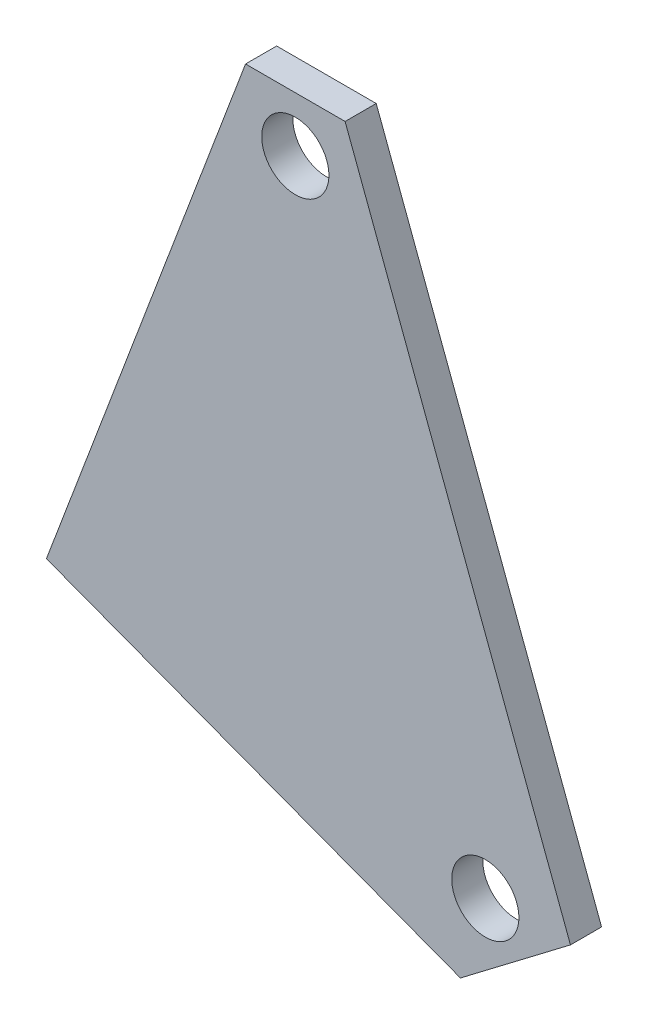
ISO-10303-21;
HEADER;
FILE_DESCRIPTION(('STEP AP214'),'2;1');
FILE_NAME('part.step','',(''),(''),'','','');
FILE_SCHEMA(('AUTOMOTIVE_DESIGN { 1 0 10303 214 1 1 1 1 }'));
ENDSEC;
DATA;
#1=APPLICATION_CONTEXT('core data for automotive mechanical design processes');
#2=APPLICATION_PROTOCOL_DEFINITION('international standard','automotive_design',2000,#1);
#3=PRODUCT_CONTEXT('',#1,'mechanical');
#4=PRODUCT('Part','Part','',(#3));
#5=PRODUCT_RELATED_PRODUCT_CATEGORY('part','',(#4));
#6=PRODUCT_DEFINITION_FORMATION('','',#4);
#7=PRODUCT_DEFINITION_CONTEXT('part definition',#1,'design');
#8=PRODUCT_DEFINITION('design','',#6,#7);
#9=PRODUCT_DEFINITION_SHAPE('','',#8);
#10=(LENGTH_UNIT() NAMED_UNIT(*) SI_UNIT(.MILLI.,.METRE.));
#11=(NAMED_UNIT(*) PLANE_ANGLE_UNIT() SI_UNIT($,.RADIAN.));
#12=(NAMED_UNIT(*) SI_UNIT($,.STERADIAN.) SOLID_ANGLE_UNIT());
#13=UNCERTAINTY_MEASURE_WITH_UNIT(LENGTH_MEASURE(1.E-05),#10,'distance_accuracy_value','');
#14=(GEOMETRIC_REPRESENTATION_CONTEXT(3) GLOBAL_UNCERTAINTY_ASSIGNED_CONTEXT((#13)) GLOBAL_UNIT_ASSIGNED_CONTEXT((#10,
#11,#12)) REPRESENTATION_CONTEXT('',''));
#15=CARTESIAN_POINT('',(0.,0.,0.));
#16=DIRECTION('',(0.,0.,1.));
#17=DIRECTION('',(1.,0.,0.));
#18=AXIS2_PLACEMENT_3D('',#15,#16,#17);
#19=CARTESIAN_POINT('',(0.,0.,120.960358825756));
#20=DIRECTION('',(0.,0.,-1.));
#21=DIRECTION('',(-1.,0.,0.));
#22=AXIS2_PLACEMENT_3D('',#19,#20,#21);
#23=PLANE('',#22);
#24=DIRECTION('',(-0.351384717763196,0.936231157419192,0.));
#25=VECTOR('',#24,1.);
#26=CARTESIAN_POINT('',(31.1794863814168,80.8854892034774,120.960358825756));
#27=LINE('',#26,#25);
#28=CARTESIAN_POINT('',(54.1784532884711,19.6069294985896,120.960358825756));
#29=VERTEX_POINT('',#28);
#30=CARTESIAN_POINT('',(31.1794863814168,80.8854892034774,120.960358825756));
#31=VERTEX_POINT('',#30);
#32=EDGE_CURVE('E117',#29,#31,#27,.T.);
#33=ORIENTED_EDGE('',*,*,#32,.T.);
#34=DIRECTION('',(-1.,0.,0.));
#35=VECTOR('',#34,1.);
#36=CARTESIAN_POINT('',(21.0194863814168,80.8854892034774,120.960358825756));
#37=LINE('',#36,#35);
#38=CARTESIAN_POINT('',(21.0194863814168,80.8854892034774,120.960358825756));
#39=VERTEX_POINT('',#38);
#40=EDGE_CURVE('E84',#31,#39,#37,.T.);
#41=ORIENTED_EDGE('',*,*,#40,.T.);
#42=DIRECTION('',(-0.352853359566901,-0.935678634276936,0.));
#43=VECTOR('',#42,1.);
#44=CARTESIAN_POINT('',(0.699486381416827,27.0019442888301,120.960358825756));
#45=LINE('',#44,#43);
#46=CARTESIAN_POINT('',(0.699486381416827,27.0019442888301,120.960358825756));
#47=VERTEX_POINT('',#46);
#48=EDGE_CURVE('E88',#39,#47,#45,.T.);
#49=ORIENTED_EDGE('',*,*,#48,.T.);
#50=DIRECTION('',(0.935678634276935,-0.352853359566901,0.));
#51=VECTOR('',#50,1.);
#52=CARTESIAN_POINT('',(42.949199140972,11.0691736325181,120.960358825756));
#53=LINE('',#52,#51);
#54=CARTESIAN_POINT('',(42.949199140972,11.0691736325181,120.960358825756));
#55=VERTEX_POINT('',#54);
#56=EDGE_CURVE('E92',#47,#55,#53,.T.);
#57=ORIENTED_EDGE('',*,*,#56,.T.);
#58=DIRECTION('',(0.79604187466067,0.605241549950701,0.));
#59=VECTOR('',#58,1.);
#60=CARTESIAN_POINT('',(54.1784532884711,19.6069294985896,120.960358825756));
#61=LINE('',#60,#59);
#62=EDGE_CURVE('E50',#55,#29,#61,.T.);
#63=ORIENTED_EDGE('',*,*,#62,.T.);
#64=EDGE_LOOP('',(#33,#41,#49,#57,#63));
#65=FACE_BOUND('',#64,.T.);
#66=CARTESIAN_POINT('',(45.489199140972,19.3819442888301,120.960358825756));
#67=DIRECTION('',(0.,0.,1.));
#68=DIRECTION('',(1.,0.,0.));
#69=AXIS2_PLACEMENT_3D('',#66,#67,#68);
#70=CIRCLE('',#69,3.429);
#71=CARTESIAN_POINT('',(48.918199140972,19.3819442888301,120.960358825756));
#72=VERTEX_POINT('',#71);
#73=EDGE_CURVE('E112',#72,#72,#70,.T.);
#74=ORIENTED_EDGE('',*,*,#73,.F.);
#75=EDGE_LOOP('',(#74));
#76=FACE_BOUND('',#75,.T.);
#77=CARTESIAN_POINT('',(26.0994863814168,75.2974892034774,120.960358825756));
#78=DIRECTION('',(0.,0.,1.));
#79=DIRECTION('',(1.,0.,0.));
#80=AXIS2_PLACEMENT_3D('',#77,#78,#79);
#81=CIRCLE('',#80,3.429);
#82=CARTESIAN_POINT('',(29.5284863814168,75.2974892034774,120.960358825756));
#83=VERTEX_POINT('',#82);
#84=EDGE_CURVE('E153',#83,#83,#81,.T.);
#85=ORIENTED_EDGE('',*,*,#84,.F.);
#86=EDGE_LOOP('',(#85));
#87=FACE_BOUND('',#86,.T.);
#88=ADVANCED_FACE('F33',(#65,#76,#87),#23,.F.);
#89=CARTESIAN_POINT('',(0.,0.,117.785358825756));
#90=DIRECTION('',(0.,0.,-1.));
#91=DIRECTION('',(-1.,0.,0.));
#92=AXIS2_PLACEMENT_3D('',#89,#90,#91);
#93=PLANE('',#92);
#94=CARTESIAN_POINT('',(45.489199140972,19.3819442888301,117.785358825756));
#95=DIRECTION('',(0.,0.,1.));
#96=DIRECTION('',(1.,0.,0.));
#97=AXIS2_PLACEMENT_3D('',#94,#95,#96);
#98=CIRCLE('',#97,3.429);
#99=CARTESIAN_POINT('',(48.918199140972,19.3819442888301,117.785358825756));
#100=VERTEX_POINT('',#99);
#101=EDGE_CURVE('E158',#100,#100,#98,.T.);
#102=ORIENTED_EDGE('',*,*,#101,.T.);
#103=EDGE_LOOP('',(#102));
#104=FACE_BOUND('',#103,.T.);
#105=DIRECTION('',(-0.351384717763196,0.936231157419192,0.));
#106=VECTOR('',#105,1.);
#107=CARTESIAN_POINT('',(31.1794863814168,80.8854892034774,117.785358825756));
#108=LINE('',#107,#106);
#109=CARTESIAN_POINT('',(54.1784532884711,19.6069294985896,117.785358825756));
#110=VERTEX_POINT('',#109);
#111=CARTESIAN_POINT('',(31.1794863814168,80.8854892034774,117.785358825756));
#112=VERTEX_POINT('',#111);
#113=EDGE_CURVE('E108',#110,#112,#108,.T.);
#114=ORIENTED_EDGE('',*,*,#113,.F.);
#115=DIRECTION('',(0.79604187466067,0.605241549950701,0.));
#116=VECTOR('',#115,1.);
#117=CARTESIAN_POINT('',(54.1784532884711,19.6069294985896,117.785358825756));
#118=LINE('',#117,#116);
#119=CARTESIAN_POINT('',(42.949199140972,11.0691736325181,117.785358825756));
#120=VERTEX_POINT('',#119);
#121=EDGE_CURVE('E76',#120,#110,#118,.T.);
#122=ORIENTED_EDGE('',*,*,#121,.F.);
#123=DIRECTION('',(0.935678634276935,-0.352853359566901,0.));
#124=VECTOR('',#123,1.);
#125=CARTESIAN_POINT('',(42.949199140972,11.0691736325181,117.785358825756));
#126=LINE('',#125,#124);
#127=CARTESIAN_POINT('',(0.699486381416827,27.0019442888301,117.785358825756));
#128=VERTEX_POINT('',#127);
#129=EDGE_CURVE('E70',#128,#120,#126,.T.);
#130=ORIENTED_EDGE('',*,*,#129,.F.);
#131=DIRECTION('',(-0.352853359566901,-0.935678634276936,0.));
#132=VECTOR('',#131,1.);
#133=CARTESIAN_POINT('',(0.699486381416827,27.0019442888301,117.785358825756));
#134=LINE('',#133,#132);
#135=CARTESIAN_POINT('',(21.0194863814168,80.8854892034774,117.785358825756));
#136=VERTEX_POINT('',#135);
#137=EDGE_CURVE('E99',#136,#128,#134,.T.);
#138=ORIENTED_EDGE('',*,*,#137,.F.);
#139=DIRECTION('',(-1.,0.,0.));
#140=VECTOR('',#139,1.);
#141=CARTESIAN_POINT('',(21.0194863814168,80.8854892034774,117.785358825756));
#142=LINE('',#141,#140);
#143=EDGE_CURVE('E111',#112,#136,#142,.T.);
#144=ORIENTED_EDGE('',*,*,#143,.F.);
#145=EDGE_LOOP('',(#114,#122,#130,#138,#144));
#146=FACE_BOUND('',#145,.T.);
#147=CARTESIAN_POINT('',(26.0994863814168,75.2974892034774,117.785358825756));
#148=DIRECTION('',(0.,0.,1.));
#149=DIRECTION('',(1.,0.,0.));
#150=AXIS2_PLACEMENT_3D('',#147,#148,#149);
#151=CIRCLE('',#150,3.429);
#152=CARTESIAN_POINT('',(29.5284863814168,75.2974892034774,117.785358825756));
#153=VERTEX_POINT('',#152);
#154=EDGE_CURVE('E156',#153,#153,#151,.T.);
#155=ORIENTED_EDGE('',*,*,#154,.T.);
#156=EDGE_LOOP('',(#155));
#157=FACE_BOUND('',#156,.T.);
#158=ADVANCED_FACE('F121',(#104,#146,#157),#93,.T.);
#159=CARTESIAN_POINT('',(31.1794863814168,80.8854892034774,120.960358825756));
#160=DIRECTION('',(-0.936231157419191,-0.351384717763196,0.));
#161=DIRECTION('',(0.351384717763196,-0.936231157419192,0.));
#162=AXIS2_PLACEMENT_3D('',#159,#160,#161);
#163=PLANE('',#162);
#164=ORIENTED_EDGE('',*,*,#113,.T.);
#165=DIRECTION('',(0.,0.,-1.));
#166=VECTOR('',#165,1.);
#167=CARTESIAN_POINT('',(31.1794863814168,80.8854892034774,120.960358825756));
#168=LINE('',#167,#166);
#169=EDGE_CURVE('E11',#31,#112,#168,.T.);
#170=ORIENTED_EDGE('',*,*,#169,.F.);
#171=ORIENTED_EDGE('',*,*,#32,.F.);
#172=DIRECTION('',(0.,0.,-1.));
#173=VECTOR('',#172,1.);
#174=CARTESIAN_POINT('',(54.1784532884711,19.6069294985896,120.960358825756));
#175=LINE('',#174,#173);
#176=EDGE_CURVE('E104',#29,#110,#175,.T.);
#177=ORIENTED_EDGE('',*,*,#176,.T.);
#178=EDGE_LOOP('',(#164,#170,#171,#177));
#179=FACE_BOUND('',#178,.T.);
#180=ADVANCED_FACE('F35',(#179),#163,.F.);
#181=CARTESIAN_POINT('',(21.0194863814168,80.8854892034774,120.960358825756));
#182=DIRECTION('',(0.,-1.,0.));
#183=DIRECTION('',(0.,0.,-1.));
#184=AXIS2_PLACEMENT_3D('',#181,#182,#183);
#185=PLANE('',#184);
#186=ORIENTED_EDGE('',*,*,#143,.T.);
#187=DIRECTION('',(0.,0.,-1.));
#188=VECTOR('',#187,1.);
#189=CARTESIAN_POINT('',(21.0194863814168,80.8854892034774,120.960358825756));
#190=LINE('',#189,#188);
#191=EDGE_CURVE('E42',#39,#136,#190,.T.);
#192=ORIENTED_EDGE('',*,*,#191,.F.);
#193=ORIENTED_EDGE('',*,*,#40,.F.);
#194=ORIENTED_EDGE('',*,*,#169,.T.);
#195=EDGE_LOOP('',(#186,#192,#193,#194));
#196=FACE_BOUND('',#195,.T.);
#197=ADVANCED_FACE('F192',(#196),#185,.F.);
#198=CARTESIAN_POINT('',(0.699486381416827,27.0019442888301,120.960358825756));
#199=DIRECTION('',(0.935678634276935,-0.352853359566901,0.));
#200=DIRECTION('',(0.352853359566901,0.935678634276936,0.));
#201=AXIS2_PLACEMENT_3D('',#198,#199,#200);
#202=PLANE('',#201);
#203=ORIENTED_EDGE('',*,*,#137,.T.);
#204=DIRECTION('',(0.,0.,-1.));
#205=VECTOR('',#204,1.);
#206=CARTESIAN_POINT('',(0.699486381416827,27.0019442888301,120.960358825756));
#207=LINE('',#206,#205);
#208=EDGE_CURVE('E96',#47,#128,#207,.T.);
#209=ORIENTED_EDGE('',*,*,#208,.F.);
#210=ORIENTED_EDGE('',*,*,#48,.F.);
#211=ORIENTED_EDGE('',*,*,#191,.T.);
#212=EDGE_LOOP('',(#203,#209,#210,#211));
#213=FACE_BOUND('',#212,.T.);
#214=ADVANCED_FACE('F97',(#213),#202,.F.);
#215=CARTESIAN_POINT('',(42.949199140972,11.0691736325181,120.960358825756));
#216=DIRECTION('',(0.352853359566901,0.935678634276936,0.));
#217=DIRECTION('',(-0.935678634276936,0.352853359566901,0.));
#218=AXIS2_PLACEMENT_3D('',#215,#216,#217);
#219=PLANE('',#218);
#220=ORIENTED_EDGE('',*,*,#129,.T.);
#221=DIRECTION('',(0.,0.,-1.));
#222=VECTOR('',#221,1.);
#223=CARTESIAN_POINT('',(42.949199140972,11.0691736325181,120.960358825756));
#224=LINE('',#223,#222);
#225=EDGE_CURVE('E100',#55,#120,#224,.T.);
#226=ORIENTED_EDGE('',*,*,#225,.F.);
#227=ORIENTED_EDGE('',*,*,#56,.F.);
#228=ORIENTED_EDGE('',*,*,#208,.T.);
#229=EDGE_LOOP('',(#220,#226,#227,#228));
#230=FACE_BOUND('',#229,.T.);
#231=ADVANCED_FACE('F102',(#230),#219,.F.);
#232=CARTESIAN_POINT('',(54.1784532884711,19.6069294985896,120.960358825756));
#233=DIRECTION('',(-0.605241549950701,0.79604187466067,0.));
#234=DIRECTION('',(-0.79604187466067,-0.605241549950701,0.));
#235=AXIS2_PLACEMENT_3D('',#232,#233,#234);
#236=PLANE('',#235);
#237=ORIENTED_EDGE('',*,*,#121,.T.);
#238=ORIENTED_EDGE('',*,*,#176,.F.);
#239=ORIENTED_EDGE('',*,*,#62,.F.);
#240=ORIENTED_EDGE('',*,*,#225,.T.);
#241=EDGE_LOOP('',(#237,#238,#239,#240));
#242=FACE_BOUND('',#241,.T.);
#243=ADVANCED_FACE('F126',(#242),#236,.F.);
#244=CARTESIAN_POINT('',(45.489199140972,19.3819442888301,120.960358825756));
#245=DIRECTION('',(0.,0.,-1.));
#246=DIRECTION('',(-1.,0.,0.));
#247=AXIS2_PLACEMENT_3D('',#244,#245,#246);
#248=CYLINDRICAL_SURFACE('',#247,3.429);
#249=ORIENTED_EDGE('',*,*,#73,.T.);
#250=EDGE_LOOP('',(#249));
#251=FACE_BOUND('',#250,.T.);
#252=ORIENTED_EDGE('',*,*,#101,.F.);
#253=EDGE_LOOP('',(#252));
#254=FACE_BOUND('',#253,.T.);
#255=ADVANCED_FACE('F128',(#251,#254),#248,.F.);
#256=CARTESIAN_POINT('',(26.0994863814168,75.2974892034774,120.960358825756));
#257=DIRECTION('',(0.,0.,-1.));
#258=DIRECTION('',(-1.,0.,0.));
#259=AXIS2_PLACEMENT_3D('',#256,#257,#258);
#260=CYLINDRICAL_SURFACE('',#259,3.429);
#261=ORIENTED_EDGE('',*,*,#84,.T.);
#262=EDGE_LOOP('',(#261));
#263=FACE_BOUND('',#262,.T.);
#264=ORIENTED_EDGE('',*,*,#154,.F.);
#265=EDGE_LOOP('',(#264));
#266=FACE_BOUND('',#265,.T.);
#267=ADVANCED_FACE('F134',(#263,#266),#260,.F.);
#268=CLOSED_SHELL('',(#88,#158,#180,#197,#214,#231,#243,#255,#267));
#269=MANIFOLD_SOLID_BREP('B2',#268);
#270=ADVANCED_BREP_SHAPE_REPRESENTATION('',(#18,#269),#14);
#271=SHAPE_DEFINITION_REPRESENTATION(#9,#270);
ENDSEC;
END-ISO-10303-21;
